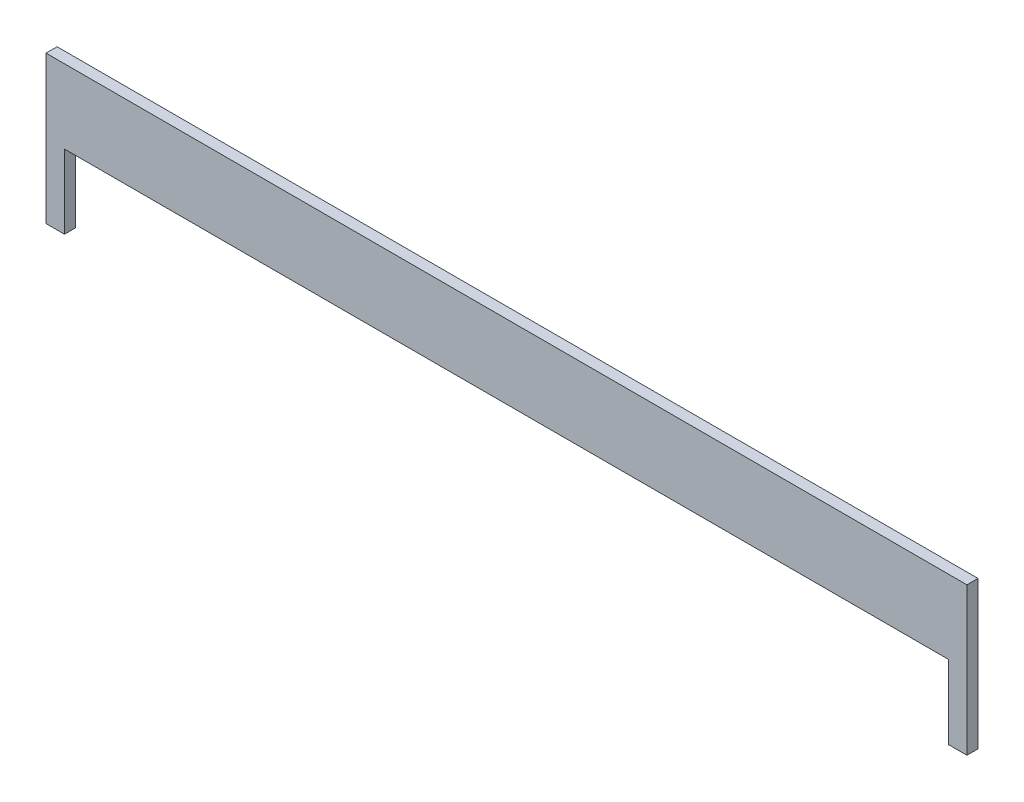
ISO-10303-21;
HEADER;
FILE_DESCRIPTION(('STEP AP214'),'2;1');
FILE_NAME('part.step','',(''),(''),'','','');
FILE_SCHEMA(('AUTOMOTIVE_DESIGN { 1 0 10303 214 1 1 1 1 }'));
ENDSEC;
DATA;
#1=APPLICATION_CONTEXT('core data for automotive mechanical design processes');
#2=APPLICATION_PROTOCOL_DEFINITION('international standard','automotive_design',2000,#1);
#3=PRODUCT_CONTEXT('',#1,'mechanical');
#4=PRODUCT('Part','Part','',(#3));
#5=PRODUCT_RELATED_PRODUCT_CATEGORY('part','',(#4));
#6=PRODUCT_DEFINITION_FORMATION('','',#4);
#7=PRODUCT_DEFINITION_CONTEXT('part definition',#1,'design');
#8=PRODUCT_DEFINITION('design','',#6,#7);
#9=PRODUCT_DEFINITION_SHAPE('','',#8);
#10=(LENGTH_UNIT() NAMED_UNIT(*) SI_UNIT(.MILLI.,.METRE.));
#11=(NAMED_UNIT(*) PLANE_ANGLE_UNIT() SI_UNIT($,.RADIAN.));
#12=(NAMED_UNIT(*) SI_UNIT($,.STERADIAN.) SOLID_ANGLE_UNIT());
#13=UNCERTAINTY_MEASURE_WITH_UNIT(LENGTH_MEASURE(1.E-05),#10,'distance_accuracy_value','');
#14=(GEOMETRIC_REPRESENTATION_CONTEXT(3) GLOBAL_UNCERTAINTY_ASSIGNED_CONTEXT((#13)) GLOBAL_UNIT_ASSIGNED_CONTEXT((#10,
#11,#12)) REPRESENTATION_CONTEXT('',''));
#15=CARTESIAN_POINT('',(0.,0.,0.));
#16=DIRECTION('',(0.,0.,1.));
#17=DIRECTION('',(1.,0.,0.));
#18=AXIS2_PLACEMENT_3D('',#15,#16,#17);
#19=CARTESIAN_POINT('',(0.,-40.,3.));
#20=DIRECTION('',(0.,1.,0.));
#21=DIRECTION('',(0.,0.,1.));
#22=AXIS2_PLACEMENT_3D('',#19,#20,#21);
#23=PLANE('',#22);
#24=DIRECTION('',(1.,0.,0.));
#25=VECTOR('',#24,1.);
#26=CARTESIAN_POINT('',(0.,-40.,0.));
#27=LINE('',#26,#25);
#28=CARTESIAN_POINT('',(0.,-40.,0.));
#29=VERTEX_POINT('',#28);
#30=CARTESIAN_POINT('',(5.,-40.,0.));
#31=VERTEX_POINT('',#30);
#32=EDGE_CURVE('E118',#29,#31,#27,.T.);
#33=ORIENTED_EDGE('',*,*,#32,.T.);
#34=DIRECTION('',(0.,0.,1.));
#35=VECTOR('',#34,1.);
#36=CARTESIAN_POINT('',(5.,-40.,-2.));
#37=LINE('',#36,#35);
#38=CARTESIAN_POINT('',(5.,-40.,3.));
#39=VERTEX_POINT('',#38);
#40=EDGE_CURVE('E110',#31,#39,#37,.T.);
#41=ORIENTED_EDGE('',*,*,#40,.T.);
#42=DIRECTION('',(1.,0.,0.));
#43=VECTOR('',#42,1.);
#44=CARTESIAN_POINT('',(0.,-40.,3.));
#45=LINE('',#44,#43);
#46=CARTESIAN_POINT('',(0.,-40.,3.));
#47=VERTEX_POINT('',#46);
#48=EDGE_CURVE('E86',#47,#39,#45,.T.);
#49=ORIENTED_EDGE('',*,*,#48,.F.);
#50=DIRECTION('',(0.,0.,-1.));
#51=VECTOR('',#50,1.);
#52=CARTESIAN_POINT('',(0.,-40.,3.));
#53=LINE('',#52,#51);
#54=EDGE_CURVE('E148',#47,#29,#53,.T.);
#55=ORIENTED_EDGE('',*,*,#54,.T.);
#56=EDGE_LOOP('',(#33,#41,#49,#55));
#57=FACE_BOUND('',#56,.T.);
#58=ADVANCED_FACE('F33',(#57),#23,.F.);
#59=CARTESIAN_POINT('',(0.,0.,3.));
#60=DIRECTION('',(1.,0.,0.));
#61=DIRECTION('',(0.,1.,0.));
#62=AXIS2_PLACEMENT_3D('',#59,#60,#61);
#63=PLANE('',#62);
#64=DIRECTION('',(0.,-1.,0.));
#65=VECTOR('',#64,1.);
#66=CARTESIAN_POINT('',(0.,0.,0.));
#67=LINE('',#66,#65);
#68=CARTESIAN_POINT('',(0.,0.,0.));
#69=VERTEX_POINT('',#68);
#70=EDGE_CURVE('E134',#69,#29,#67,.T.);
#71=ORIENTED_EDGE('',*,*,#70,.T.);
#72=ORIENTED_EDGE('',*,*,#54,.F.);
#73=DIRECTION('',(0.,-1.,0.));
#74=VECTOR('',#73,1.);
#75=CARTESIAN_POINT('',(0.,0.,3.));
#76=LINE('',#75,#74);
#77=CARTESIAN_POINT('',(0.,0.,3.));
#78=VERTEX_POINT('',#77);
#79=EDGE_CURVE('E124',#78,#47,#76,.T.);
#80=ORIENTED_EDGE('',*,*,#79,.F.);
#81=DIRECTION('',(0.,0.,-1.));
#82=VECTOR('',#81,1.);
#83=CARTESIAN_POINT('',(0.,0.,3.));
#84=LINE('',#83,#82);
#85=EDGE_CURVE('E133',#78,#69,#84,.T.);
#86=ORIENTED_EDGE('',*,*,#85,.T.);
#87=EDGE_LOOP('',(#71,#72,#80,#86));
#88=FACE_BOUND('',#87,.T.);
#89=ADVANCED_FACE('F35',(#88),#63,.F.);
#90=CARTESIAN_POINT('',(244.5,-40.,3.));
#91=VERTEX_POINT('',#90);
#92=CARTESIAN_POINT('',(249.5,-40.,3.));
#93=VERTEX_POINT('',#92);
#94=EDGE_CURVE('E127',#91,#93,#45,.T.);
#95=ORIENTED_EDGE('',*,*,#94,.F.);
#96=DIRECTION('',(0.,0.,1.));
#97=VECTOR('',#96,1.);
#98=CARTESIAN_POINT('',(244.5,-40.,-2.));
#99=LINE('',#98,#97);
#100=CARTESIAN_POINT('',(244.5,-40.,0.));
#101=VERTEX_POINT('',#100);
#102=EDGE_CURVE('E119',#101,#91,#99,.T.);
#103=ORIENTED_EDGE('',*,*,#102,.F.);
#104=CARTESIAN_POINT('',(249.5,-40.,0.));
#105=VERTEX_POINT('',#104);
#106=EDGE_CURVE('E137',#101,#105,#27,.T.);
#107=ORIENTED_EDGE('',*,*,#106,.T.);
#108=DIRECTION('',(0.,0.,-1.));
#109=VECTOR('',#108,1.);
#110=CARTESIAN_POINT('',(249.5,-40.,3.));
#111=LINE('',#110,#109);
#112=EDGE_CURVE('E145',#93,#105,#111,.T.);
#113=ORIENTED_EDGE('',*,*,#112,.F.);
#114=EDGE_LOOP('',(#95,#103,#107,#113));
#115=FACE_BOUND('',#114,.T.);
#116=ADVANCED_FACE('F169',(#115),#23,.F.);
#117=CARTESIAN_POINT('',(249.5,0.,3.));
#118=DIRECTION('',(-1.,0.,0.));
#119=DIRECTION('',(0.,0.,1.));
#120=AXIS2_PLACEMENT_3D('',#117,#118,#119);
#121=PLANE('',#120);
#122=DIRECTION('',(0.,1.,0.));
#123=VECTOR('',#122,1.);
#124=CARTESIAN_POINT('',(249.5,0.,0.));
#125=LINE('',#124,#123);
#126=CARTESIAN_POINT('',(249.5,0.,0.));
#127=VERTEX_POINT('',#126);
#128=EDGE_CURVE('E139',#105,#127,#125,.T.);
#129=ORIENTED_EDGE('',*,*,#128,.T.);
#130=DIRECTION('',(0.,0.,-1.));
#131=VECTOR('',#130,1.);
#132=CARTESIAN_POINT('',(249.5,0.,3.));
#133=LINE('',#132,#131);
#134=CARTESIAN_POINT('',(249.5,0.,3.));
#135=VERTEX_POINT('',#134);
#136=EDGE_CURVE('E143',#135,#127,#133,.T.);
#137=ORIENTED_EDGE('',*,*,#136,.F.);
#138=DIRECTION('',(0.,1.,0.));
#139=VECTOR('',#138,1.);
#140=CARTESIAN_POINT('',(249.5,0.,3.));
#141=LINE('',#140,#139);
#142=EDGE_CURVE('E126',#93,#135,#141,.T.);
#143=ORIENTED_EDGE('',*,*,#142,.F.);
#144=ORIENTED_EDGE('',*,*,#112,.T.);
#145=EDGE_LOOP('',(#129,#137,#143,#144));
#146=FACE_BOUND('',#145,.T.);
#147=ADVANCED_FACE('F174',(#146),#121,.F.);
#148=CARTESIAN_POINT('',(0.,0.,3.));
#149=DIRECTION('',(0.,-1.,0.));
#150=DIRECTION('',(0.,0.,-1.));
#151=AXIS2_PLACEMENT_3D('',#148,#149,#150);
#152=PLANE('',#151);
#153=DIRECTION('',(-1.,0.,0.));
#154=VECTOR('',#153,1.);
#155=CARTESIAN_POINT('',(0.,0.,0.));
#156=LINE('',#155,#154);
#157=EDGE_CURVE('E78',#127,#69,#156,.T.);
#158=ORIENTED_EDGE('',*,*,#157,.T.);
#159=ORIENTED_EDGE('',*,*,#85,.F.);
#160=DIRECTION('',(-1.,0.,0.));
#161=VECTOR('',#160,1.);
#162=CARTESIAN_POINT('',(0.,0.,3.));
#163=LINE('',#162,#161);
#164=EDGE_CURVE('E57',#135,#78,#163,.T.);
#165=ORIENTED_EDGE('',*,*,#164,.F.);
#166=ORIENTED_EDGE('',*,*,#136,.T.);
#167=EDGE_LOOP('',(#158,#159,#165,#166));
#168=FACE_BOUND('',#167,.T.);
#169=ADVANCED_FACE('F175',(#168),#152,.F.);
#170=CARTESIAN_POINT('',(0.,0.,3.));
#171=DIRECTION('',(0.,0.,1.));
#172=DIRECTION('',(1.,0.,0.));
#173=AXIS2_PLACEMENT_3D('',#170,#171,#172);
#174=PLANE('',#173);
#175=DIRECTION('',(0.,-1.,0.));
#176=VECTOR('',#175,1.);
#177=CARTESIAN_POINT('',(5.,-40.,3.));
#178=LINE('',#177,#176);
#179=CARTESIAN_POINT('',(5.,-20.,3.));
#180=VERTEX_POINT('',#179);
#181=EDGE_CURVE('E108',#180,#39,#178,.T.);
#182=ORIENTED_EDGE('',*,*,#181,.F.);
#183=DIRECTION('',(-1.,0.,0.));
#184=VECTOR('',#183,1.);
#185=CARTESIAN_POINT('',(5.,-20.,3.));
#186=LINE('',#185,#184);
#187=CARTESIAN_POINT('',(244.5,-20.,3.));
#188=VERTEX_POINT('',#187);
#189=EDGE_CURVE('E120',#188,#180,#186,.T.);
#190=ORIENTED_EDGE('',*,*,#189,.F.);
#191=DIRECTION('',(0.,1.,0.));
#192=VECTOR('',#191,1.);
#193=CARTESIAN_POINT('',(244.5,-40.,3.));
#194=LINE('',#193,#192);
#195=EDGE_CURVE('E115',#91,#188,#194,.T.);
#196=ORIENTED_EDGE('',*,*,#195,.F.);
#197=ORIENTED_EDGE('',*,*,#94,.T.);
#198=ORIENTED_EDGE('',*,*,#142,.T.);
#199=ORIENTED_EDGE('',*,*,#164,.T.);
#200=ORIENTED_EDGE('',*,*,#79,.T.);
#201=ORIENTED_EDGE('',*,*,#48,.T.);
#202=EDGE_LOOP('',(#182,#190,#196,#197,#198,#199,#200,#201));
#203=FACE_BOUND('',#202,.T.);
#204=ADVANCED_FACE('F122',(#203),#174,.T.);
#205=CARTESIAN_POINT('',(0.,0.,0.));
#206=DIRECTION('',(0.,0.,1.));
#207=DIRECTION('',(1.,0.,0.));
#208=AXIS2_PLACEMENT_3D('',#205,#206,#207);
#209=PLANE('',#208);
#210=DIRECTION('',(-1.,0.,0.));
#211=VECTOR('',#210,1.);
#212=CARTESIAN_POINT('',(0.,-20.,0.));
#213=LINE('',#212,#211);
#214=CARTESIAN_POINT('',(244.5,-20.,0.));
#215=VERTEX_POINT('',#214);
#216=CARTESIAN_POINT('',(5.,-20.,0.));
#217=VERTEX_POINT('',#216);
#218=EDGE_CURVE('E41',#215,#217,#213,.T.);
#219=ORIENTED_EDGE('',*,*,#218,.T.);
#220=DIRECTION('',(0.,-1.,0.));
#221=VECTOR('',#220,1.);
#222=CARTESIAN_POINT('',(4.99999999999999,0.,0.));
#223=LINE('',#222,#221);
#224=EDGE_CURVE('E11',#217,#31,#223,.T.);
#225=ORIENTED_EDGE('',*,*,#224,.T.);
#226=ORIENTED_EDGE('',*,*,#32,.F.);
#227=ORIENTED_EDGE('',*,*,#70,.F.);
#228=ORIENTED_EDGE('',*,*,#157,.F.);
#229=ORIENTED_EDGE('',*,*,#128,.F.);
#230=ORIENTED_EDGE('',*,*,#106,.F.);
#231=DIRECTION('',(0.,1.,0.));
#232=VECTOR('',#231,1.);
#233=CARTESIAN_POINT('',(244.5,0.,0.));
#234=LINE('',#233,#232);
#235=EDGE_CURVE('E150',#101,#215,#234,.T.);
#236=ORIENTED_EDGE('',*,*,#235,.T.);
#237=EDGE_LOOP('',(#219,#225,#226,#227,#228,#229,#230,#236));
#238=FACE_BOUND('',#237,.T.);
#239=ADVANCED_FACE('F154',(#238),#209,.F.);
#240=CARTESIAN_POINT('',(5.,-40.,-2.));
#241=DIRECTION('',(-1.,0.,0.));
#242=DIRECTION('',(0.,-1.,0.));
#243=AXIS2_PLACEMENT_3D('',#240,#241,#242);
#244=PLANE('',#243);
#245=DIRECTION('',(0.,0.,1.));
#246=VECTOR('',#245,1.);
#247=CARTESIAN_POINT('',(5.,-20.,-2.));
#248=LINE('',#247,#246);
#249=EDGE_CURVE('E112',#217,#180,#248,.T.);
#250=ORIENTED_EDGE('',*,*,#249,.T.);
#251=ORIENTED_EDGE('',*,*,#181,.T.);
#252=ORIENTED_EDGE('',*,*,#40,.F.);
#253=ORIENTED_EDGE('',*,*,#224,.F.);
#254=EDGE_LOOP('',(#250,#251,#252,#253));
#255=FACE_BOUND('',#254,.T.);
#256=ADVANCED_FACE('F109',(#255),#244,.F.);
#257=CARTESIAN_POINT('',(5.,-20.,-2.));
#258=DIRECTION('',(0.,1.,0.));
#259=DIRECTION('',(0.,0.,1.));
#260=AXIS2_PLACEMENT_3D('',#257,#258,#259);
#261=PLANE('',#260);
#262=DIRECTION('',(0.,0.,1.));
#263=VECTOR('',#262,1.);
#264=CARTESIAN_POINT('',(244.5,-20.,-2.));
#265=LINE('',#264,#263);
#266=EDGE_CURVE('E48',#215,#188,#265,.T.);
#267=ORIENTED_EDGE('',*,*,#266,.T.);
#268=ORIENTED_EDGE('',*,*,#189,.T.);
#269=ORIENTED_EDGE('',*,*,#249,.F.);
#270=ORIENTED_EDGE('',*,*,#218,.F.);
#271=EDGE_LOOP('',(#267,#268,#269,#270));
#272=FACE_BOUND('',#271,.T.);
#273=ADVANCED_FACE('F157',(#272),#261,.F.);
#274=CARTESIAN_POINT('',(244.5,-40.,-2.));
#275=DIRECTION('',(1.,0.,0.));
#276=DIRECTION('',(0.,0.,-1.));
#277=AXIS2_PLACEMENT_3D('',#274,#275,#276);
#278=PLANE('',#277);
#279=ORIENTED_EDGE('',*,*,#102,.T.);
#280=ORIENTED_EDGE('',*,*,#195,.T.);
#281=ORIENTED_EDGE('',*,*,#266,.F.);
#282=ORIENTED_EDGE('',*,*,#235,.F.);
#283=EDGE_LOOP('',(#279,#280,#281,#282));
#284=FACE_BOUND('',#283,.T.);
#285=ADVANCED_FACE('F165',(#284),#278,.F.);
#286=CLOSED_SHELL('',(#58,#89,#116,#147,#169,#204,#239,#256,#273,#285));
#287=MANIFOLD_SOLID_BREP('B2',#286);
#288=ADVANCED_BREP_SHAPE_REPRESENTATION('',(#18,#287),#14);
#289=SHAPE_DEFINITION_REPRESENTATION(#9,#288);
ENDSEC;
END-ISO-10303-21;
